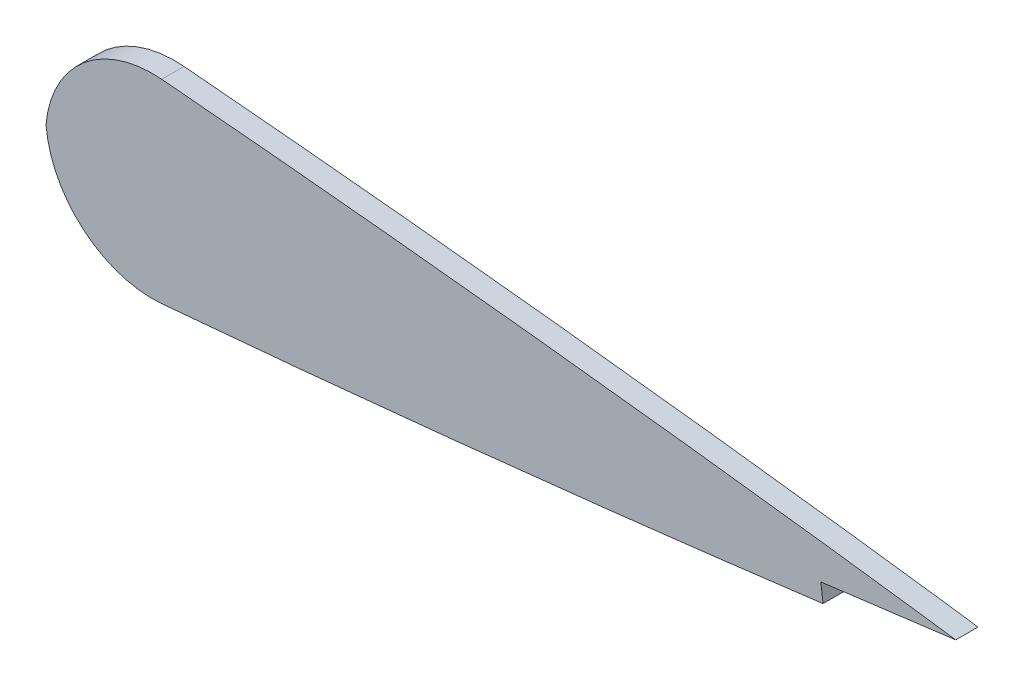
ISO-10303-21;
HEADER;
FILE_DESCRIPTION(('STEP AP214'),'2;1');
FILE_NAME('part.step','',(''),(''),'','','');
FILE_SCHEMA(('AUTOMOTIVE_DESIGN { 1 0 10303 214 1 1 1 1 }'));
ENDSEC;
DATA;
#1=APPLICATION_CONTEXT('core data for automotive mechanical design processes');
#2=APPLICATION_PROTOCOL_DEFINITION('international standard','automotive_design',2000,#1);
#3=PRODUCT_CONTEXT('',#1,'mechanical');
#4=PRODUCT('Part','Part','',(#3));
#5=PRODUCT_RELATED_PRODUCT_CATEGORY('part','',(#4));
#6=PRODUCT_DEFINITION_FORMATION('','',#4);
#7=PRODUCT_DEFINITION_CONTEXT('part definition',#1,'design');
#8=PRODUCT_DEFINITION('design','',#6,#7);
#9=PRODUCT_DEFINITION_SHAPE('','',#8);
#10=(LENGTH_UNIT() NAMED_UNIT(*) SI_UNIT(.MILLI.,.METRE.));
#11=(NAMED_UNIT(*) PLANE_ANGLE_UNIT() SI_UNIT($,.RADIAN.));
#12=(NAMED_UNIT(*) SI_UNIT($,.STERADIAN.) SOLID_ANGLE_UNIT());
#13=UNCERTAINTY_MEASURE_WITH_UNIT(LENGTH_MEASURE(1.E-05),#10,'distance_accuracy_value','');
#14=(GEOMETRIC_REPRESENTATION_CONTEXT(3) GLOBAL_UNCERTAINTY_ASSIGNED_CONTEXT((#13)) GLOBAL_UNIT_ASSIGNED_CONTEXT((#10,
#11,#12)) REPRESENTATION_CONTEXT('',''));
#15=CARTESIAN_POINT('',(0.,0.,0.));
#16=DIRECTION('',(0.,0.,1.));
#17=DIRECTION('',(1.,0.,0.));
#18=AXIS2_PLACEMENT_3D('',#15,#16,#17);
#19=CARTESIAN_POINT('',(318.77,0.4016502,3.175));
#20=CARTESIAN_POINT('',(318.651672050798,0.50081062510207,3.175));
#21=CARTESIAN_POINT('',(317.88713952083,0.407183951533016,3.175));
#22=CARTESIAN_POINT('',(316.525702267064,0.7904298347905,3.175));
#23=CARTESIAN_POINT('',(314.029007456015,1.02731081399014,3.175));
#24=CARTESIAN_POINT('',(310.665580367581,1.53568645613262,3.175));
#25=CARTESIAN_POINT('',(306.332982445315,2.1029997142592,3.175));
#26=CARTESIAN_POINT('',(301.108142880642,2.80218722429085,3.175));
#27=CARTESIAN_POINT('',(295.004655139781,3.59255228155884,3.175));
#28=CARTESIAN_POINT('',(288.066717305627,4.47252129999186,3.175));
#29=CARTESIAN_POINT('',(280.334877507848,5.42667867616247,3.175));
#30=CARTESIAN_POINT('',(271.857503413929,6.44211126091389,3.175));
#31=CARTESIAN_POINT('',(262.68670258513,7.50622472654808,3.175));
#32=CARTESIAN_POINT('',(252.878949160097,8.60453143464443,3.175));
#33=CARTESIAN_POINT('',(242.494745531819,9.72362194936592,3.175));
#34=CARTESIAN_POINT('',(231.598187206488,10.8495970231666,3.175));
#35=CARTESIAN_POINT('',(220.256428580463,11.9679230852741,3.175));
#36=CARTESIAN_POINT('',(208.539426289446,13.0629021970691,3.175));
#37=CARTESIAN_POINT('',(196.519338709918,14.1201595424354,3.175));
#38=CARTESIAN_POINT('',(184.270405083069,15.1220196708537,3.175));
#39=CARTESIAN_POINT('',(171.867889748649,16.0521472129467,3.175));
#40=CARTESIAN_POINT('',(159.388371015463,16.8932736087619,3.175));
#41=CARTESIAN_POINT('',(146.908740176365,17.6278116310836,3.175));
#42=CARTESIAN_POINT('',(134.505824676557,18.23720410278,3.175));
#43=CARTESIAN_POINT('',(122.256224526093,18.705201006698,3.175));
#44=CARTESIAN_POINT('',(110.23510919994,19.0165345268771,3.175));
#45=CARTESIAN_POINT('',(98.5167667377854,19.1559979551147,3.175));
#46=CARTESIAN_POINT('',(87.1732015056204,19.1125234147679,3.175));
#47=CARTESIAN_POINT('',(76.2743495407503,18.8777134468916,3.175));
#48=CARTESIAN_POINT('',(65.8872982521429,18.4456158754961,3.175));
#49=CARTESIAN_POINT('',(56.0759819312477,17.8151004006929,3.175));
#50=CARTESIAN_POINT('',(46.9007012854392,16.9880642018893,3.175));
#51=CARTESIAN_POINT('',(38.4176025007467,15.9709664672286,3.175));
#52=CARTESIAN_POINT('',(30.6783927826995,14.7724611931374,3.175));
#53=CARTESIAN_POINT('',(23.7299698701266,13.4050657428601,3.175));
#54=CARTESIAN_POINT('',(17.6130594258367,11.8842416218078,3.175));
#55=CARTESIAN_POINT('',(12.3624203887116,10.2248187616682,3.175));
#56=CARTESIAN_POINT('',(8.00472945000562,8.44225238170004,3.175));
#57=CARTESIAN_POINT('',(4.55388340735938,6.54860238146803,3.175));
#58=CARTESIAN_POINT('',(2.01519229032135,4.54013127991722,3.175));
#59=CARTESIAN_POINT('',(0.389181284538515,2.36824959719999,3.175));
#60=CARTESIAN_POINT('',(-0.181372315669338,0.,3.175));
#61=CARTESIAN_POINT('',(0.389181284538492,-2.36824959719995,3.175));
#62=CARTESIAN_POINT('',(2.01519229032142,-4.5401312799173,3.175));
#63=CARTESIAN_POINT('',(4.55388340735933,-6.54860238146799,3.175));
#64=CARTESIAN_POINT('',(8.00472945000561,-8.44225238170004,3.175));
#65=CARTESIAN_POINT('',(12.3624203887116,-10.2248187616682,3.175));
#66=CARTESIAN_POINT('',(17.6130594258367,-11.8842416218078,3.175));
#67=CARTESIAN_POINT('',(23.7299698701266,-13.4050657428601,3.175));
#68=CARTESIAN_POINT('',(30.6783927826996,-14.7724611931374,3.175));
#69=CARTESIAN_POINT('',(38.4176025007467,-15.9709664672285,3.175));
#70=CARTESIAN_POINT('',(46.9007012854392,-16.9880642018893,3.175));
#71=CARTESIAN_POINT('',(56.0759819312477,-17.8151004006929,3.175));
#72=CARTESIAN_POINT('',(65.8872982521429,-18.4456158754961,3.175));
#73=CARTESIAN_POINT('',(76.2743495407503,-18.8777134468916,3.175));
#74=CARTESIAN_POINT('',(87.1732015056205,-19.1125234147679,3.175));
#75=CARTESIAN_POINT('',(98.5167667377854,-19.1559979551147,3.175));
#76=CARTESIAN_POINT('',(110.23510919994,-19.0165345268771,3.175));
#77=CARTESIAN_POINT('',(122.256224526093,-18.705201006698,3.175));
#78=CARTESIAN_POINT('',(134.505824676556,-18.23720410278,3.175));
#79=CARTESIAN_POINT('',(146.908740176365,-17.6278116310836,3.175));
#80=CARTESIAN_POINT('',(159.388371015463,-16.8932736087619,3.175));
#81=CARTESIAN_POINT('',(171.867889748649,-16.0521472129467,3.175));
#82=CARTESIAN_POINT('',(184.270405083069,-15.1220196708537,3.175));
#83=CARTESIAN_POINT('',(196.519338709918,-14.1201595424354,3.175));
#84=CARTESIAN_POINT('',(208.539426289446,-13.0629021970691,3.175));
#85=CARTESIAN_POINT('',(220.256428580463,-11.9679230852741,3.175));
#86=CARTESIAN_POINT('',(231.598187206488,-10.8495970231665,3.175));
#87=CARTESIAN_POINT('',(242.494745531819,-9.72362194936593,3.175));
#88=CARTESIAN_POINT('',(252.878949160097,-8.60453143464443,3.175));
#89=CARTESIAN_POINT('',(262.68670258513,-7.50622472654809,3.175));
#90=CARTESIAN_POINT('',(271.857503413929,-6.44211126091389,3.175));
#91=CARTESIAN_POINT('',(280.334877507848,-5.42667867616247,3.175));
#92=CARTESIAN_POINT('',(288.066717305627,-4.47252129999186,3.175));
#93=CARTESIAN_POINT('',(295.004655139781,-3.59255228155884,3.175));
#94=CARTESIAN_POINT('',(301.108142880642,-2.80218722429085,3.175));
#95=CARTESIAN_POINT('',(306.332982445315,-2.10299971425921,3.175));
#96=CARTESIAN_POINT('',(310.66558036758,-1.53568645613261,3.175));
#97=CARTESIAN_POINT('',(314.029007456015,-1.02731081399015,3.175));
#98=CARTESIAN_POINT('',(316.525702267064,-0.790429834790499,3.175));
#99=CARTESIAN_POINT('',(317.88713952083,-0.407183951532999,3.175));
#100=CARTESIAN_POINT('',(318.961628570184,-0.538768719393173,3.175));
#101=CARTESIAN_POINT('',(318.961628570184,0.241062861088163,3.175));
#102=CARTESIAN_POINT('',(318.77,0.4016502,3.175));
#103=B_SPLINE_CURVE_WITH_KNOTS('',3,(#19,#20,#21,#22,#23,#24,#25,#26,#27,#28,#29,#30,#31,#32,
#33,#34,#35,#36,#37,#38,#39,#40,#41,#42,#43,#44,#45,#46,#47,#48,#49,#50,#51,#52,#53,#54,#55,#56,
#57,#58,#59,#60,#61,#62,#63,#64,#65,#66,#67,#68,#69,#70,#71,#72,#73,#74,#75,#76,#77,#78,#79,#80,
#81,#82,#83,#84,#85,#86,#87,#88,#89,#90,#91,#92,#93,#94,#95,#96,#97,#98,#99,#100,#101,#102),
.UNSPECIFIED.,.T.,.F.,(4,1,1,1,1,1,1,1,1,1,1,1,1,1,1,1,1,1,1,1,1,1,1,1,1,1,1,1,1,1,1,1,1,1,1,1,
1,1,1,1,1,1,1,1,1,1,1,1,1,1,1,1,1,1,1,1,1,1,1,1,1,1,1,1,1,1,1,1,1,1,1,1,1,1,1,1,1,1,1,1,1,4),
(0.,0.00076221465102857,0.00304470631082172,0.00683224554312919,0.0121011758037585,
0.0188175356586858,0.026939454793122,0.0364148482585568,0.0471846285955964,0.0591804130998147,
0.0723278736139124,0.0865440610891483,0.101740580336553,0.117823336433574,0.134691452208322,
0.152240154447155,0.170361289964637,0.188941007849542,0.207865435445639,0.227016078022501,
0.246275695980001,0.265524943249896,0.284644966110444,0.303520118268662,0.322034575374331,
0.340078352914118,0.357542593241702,0.374325481920834,0.390329890871888,0.405463889739095,
0.419643801445685,0.43279337139134,0.444843816743186,0.455737920704734,0.465428653233085,
0.473886320085416,0.481101634077569,0.487101684418678,0.491975368345093,0.495930677807379,
0.499382808099288,0.502834938391198,0.506790247853484,0.511663931779899,0.517663982121008,
0.524879296113161,0.533336962965492,0.543027695493843,0.553921799455391,0.565972244807237,
0.579121814752892,0.593301726459482,0.608435725326689,0.624440134277742,0.641223022956875,
0.658687263284459,0.676731040824246,0.695245497929915,0.714120650088133,0.733240672948681,
0.752489920218576,0.771749538176075,0.790900180752937,0.809824608349034,0.82840432623394,
0.846525461751422,0.864074163990254,0.880942279765002,0.897025035862024,0.912221555109428,
0.926437742584664,0.939585203098762,0.95158098760298,0.96235076794002,0.971826161405454,
0.97994808053989,0.986664440394818,0.991933370655447,0.995720909887755,0.998003401547548,
0.998765616198576,1.),.UNSPECIFIED.);
#104=DIRECTION('',(0.,0.,-1.));
#105=VECTOR('',#104,1.);
#106=SURFACE_OF_LINEAR_EXTRUSION('',#103,#105);
#107=DIRECTION('',(0.,0.,1.));
#108=VECTOR('',#107,1.);
#109=CARTESIAN_POINT('',(293.808504280091,-3.74262583123202,0.));
#110=LINE('',#109,#108);
#111=CARTESIAN_POINT('',(293.808504280091,-3.74262583123202,0.));
#112=VERTEX_POINT('',#111);
#113=CARTESIAN_POINT('',(293.808504280091,-3.74262583123202,3.175));
#114=VERTEX_POINT('',#113);
#115=EDGE_CURVE('E103',#112,#114,#110,.T.);
#116=ORIENTED_EDGE('',*,*,#115,.T.);
#117=CARTESIAN_POINT('',(199.575539960691,-13.8459475793617,3.175));
#118=VERTEX_POINT('',#117);
#119=EDGE_CURVE('E131',#118,#114,#103,.T.);
#120=ORIENTED_EDGE('',*,*,#119,.F.);
#121=DIRECTION('',(0.,0.,-1.));
#122=VECTOR('',#121,1.);
#123=CARTESIAN_POINT('',(199.575539960691,-13.8459475793617,3.175));
#124=LINE('',#123,#122);
#125=CARTESIAN_POINT('',(199.575539960691,-13.8459475793617,0.));
#126=VERTEX_POINT('',#125);
#127=EDGE_CURVE('E123',#118,#126,#124,.T.);
#128=ORIENTED_EDGE('',*,*,#127,.T.);
#129=CARTESIAN_POINT('',(318.77,0.4016502,0.));
#130=CARTESIAN_POINT('',(318.651672050798,0.50081062510207,0.));
#131=CARTESIAN_POINT('',(317.88713952083,0.407183951533016,0.));
#132=CARTESIAN_POINT('',(316.525702267064,0.7904298347905,0.));
#133=CARTESIAN_POINT('',(314.029007456015,1.02731081399014,0.));
#134=CARTESIAN_POINT('',(310.665580367581,1.53568645613262,0.));
#135=CARTESIAN_POINT('',(306.332982445315,2.1029997142592,0.));
#136=CARTESIAN_POINT('',(301.108142880642,2.80218722429085,0.));
#137=CARTESIAN_POINT('',(295.004655139781,3.59255228155884,0.));
#138=CARTESIAN_POINT('',(288.066717305627,4.47252129999186,0.));
#139=CARTESIAN_POINT('',(280.334877507848,5.42667867616247,0.));
#140=CARTESIAN_POINT('',(271.857503413929,6.44211126091389,0.));
#141=CARTESIAN_POINT('',(262.68670258513,7.50622472654808,0.));
#142=CARTESIAN_POINT('',(252.878949160097,8.60453143464443,0.));
#143=CARTESIAN_POINT('',(242.494745531819,9.72362194936592,0.));
#144=CARTESIAN_POINT('',(231.598187206488,10.8495970231666,0.));
#145=CARTESIAN_POINT('',(220.256428580463,11.9679230852741,0.));
#146=CARTESIAN_POINT('',(208.539426289446,13.0629021970691,0.));
#147=CARTESIAN_POINT('',(196.519338709918,14.1201595424354,0.));
#148=CARTESIAN_POINT('',(184.270405083069,15.1220196708537,0.));
#149=CARTESIAN_POINT('',(171.867889748649,16.0521472129467,0.));
#150=CARTESIAN_POINT('',(159.388371015463,16.8932736087619,0.));
#151=CARTESIAN_POINT('',(146.908740176365,17.6278116310836,0.));
#152=CARTESIAN_POINT('',(134.505824676557,18.23720410278,0.));
#153=CARTESIAN_POINT('',(122.256224526093,18.705201006698,0.));
#154=CARTESIAN_POINT('',(110.23510919994,19.0165345268771,0.));
#155=CARTESIAN_POINT('',(98.5167667377854,19.1559979551147,0.));
#156=CARTESIAN_POINT('',(87.1732015056204,19.1125234147679,0.));
#157=CARTESIAN_POINT('',(76.2743495407503,18.8777134468916,0.));
#158=CARTESIAN_POINT('',(65.8872982521429,18.4456158754961,0.));
#159=CARTESIAN_POINT('',(56.0759819312477,17.8151004006929,0.));
#160=CARTESIAN_POINT('',(46.9007012854392,16.9880642018893,0.));
#161=CARTESIAN_POINT('',(38.4176025007467,15.9709664672286,0.));
#162=CARTESIAN_POINT('',(30.6783927826995,14.7724611931374,0.));
#163=CARTESIAN_POINT('',(23.7299698701266,13.4050657428601,0.));
#164=CARTESIAN_POINT('',(17.6130594258367,11.8842416218078,0.));
#165=CARTESIAN_POINT('',(12.3624203887116,10.2248187616682,0.));
#166=CARTESIAN_POINT('',(8.00472945000562,8.44225238170004,0.));
#167=CARTESIAN_POINT('',(4.55388340735938,6.54860238146803,0.));
#168=CARTESIAN_POINT('',(2.01519229032135,4.54013127991722,0.));
#169=CARTESIAN_POINT('',(0.389181284538515,2.36824959719999,0.));
#170=CARTESIAN_POINT('',(-0.181372315669338,0.,0.));
#171=CARTESIAN_POINT('',(0.389181284538492,-2.36824959719995,0.));
#172=CARTESIAN_POINT('',(2.01519229032142,-4.5401312799173,0.));
#173=CARTESIAN_POINT('',(4.55388340735933,-6.54860238146799,0.));
#174=CARTESIAN_POINT('',(8.00472945000561,-8.44225238170004,0.));
#175=CARTESIAN_POINT('',(12.3624203887116,-10.2248187616682,0.));
#176=CARTESIAN_POINT('',(17.6130594258367,-11.8842416218078,0.));
#177=CARTESIAN_POINT('',(23.7299698701266,-13.4050657428601,0.));
#178=CARTESIAN_POINT('',(30.6783927826996,-14.7724611931374,0.));
#179=CARTESIAN_POINT('',(38.4176025007467,-15.9709664672285,0.));
#180=CARTESIAN_POINT('',(46.9007012854392,-16.9880642018893,0.));
#181=CARTESIAN_POINT('',(56.0759819312477,-17.8151004006929,0.));
#182=CARTESIAN_POINT('',(65.8872982521429,-18.4456158754961,0.));
#183=CARTESIAN_POINT('',(76.2743495407503,-18.8777134468916,0.));
#184=CARTESIAN_POINT('',(87.1732015056205,-19.1125234147679,0.));
#185=CARTESIAN_POINT('',(98.5167667377854,-19.1559979551147,0.));
#186=CARTESIAN_POINT('',(110.23510919994,-19.0165345268771,0.));
#187=CARTESIAN_POINT('',(122.256224526093,-18.705201006698,0.));
#188=CARTESIAN_POINT('',(134.505824676556,-18.23720410278,0.));
#189=CARTESIAN_POINT('',(146.908740176365,-17.6278116310836,0.));
#190=CARTESIAN_POINT('',(159.388371015463,-16.8932736087619,0.));
#191=CARTESIAN_POINT('',(171.867889748649,-16.0521472129467,0.));
#192=CARTESIAN_POINT('',(184.270405083069,-15.1220196708537,0.));
#193=CARTESIAN_POINT('',(196.519338709918,-14.1201595424354,0.));
#194=CARTESIAN_POINT('',(208.539426289446,-13.0629021970691,0.));
#195=CARTESIAN_POINT('',(220.256428580463,-11.9679230852741,0.));
#196=CARTESIAN_POINT('',(231.598187206488,-10.8495970231665,0.));
#197=CARTESIAN_POINT('',(242.494745531819,-9.72362194936593,0.));
#198=CARTESIAN_POINT('',(252.878949160097,-8.60453143464443,0.));
#199=CARTESIAN_POINT('',(262.68670258513,-7.50622472654809,0.));
#200=CARTESIAN_POINT('',(271.857503413929,-6.44211126091389,0.));
#201=CARTESIAN_POINT('',(280.334877507848,-5.42667867616247,0.));
#202=CARTESIAN_POINT('',(288.066717305627,-4.47252129999186,0.));
#203=CARTESIAN_POINT('',(295.004655139781,-3.59255228155884,0.));
#204=CARTESIAN_POINT('',(301.108142880642,-2.80218722429085,0.));
#205=CARTESIAN_POINT('',(306.332982445315,-2.10299971425921,0.));
#206=CARTESIAN_POINT('',(310.66558036758,-1.53568645613261,0.));
#207=CARTESIAN_POINT('',(314.029007456015,-1.02731081399015,0.));
#208=CARTESIAN_POINT('',(316.525702267064,-0.790429834790499,0.));
#209=CARTESIAN_POINT('',(317.88713952083,-0.407183951532999,0.));
#210=CARTESIAN_POINT('',(318.961628570184,-0.538768719393173,0.));
#211=CARTESIAN_POINT('',(318.961628570184,0.241062861088163,0.));
#212=CARTESIAN_POINT('',(318.77,0.4016502,0.));
#213=B_SPLINE_CURVE_WITH_KNOTS('',3,(#129,#130,#131,#132,#133,#134,#135,#136,#137,#138,#139,
#140,#141,#142,#143,#144,#145,#146,#147,#148,#149,#150,#151,#152,#153,#154,#155,#156,#157,#158,
#159,#160,#161,#162,#163,#164,#165,#166,#167,#168,#169,#170,#171,#172,#173,#174,#175,#176,#177,
#178,#179,#180,#181,#182,#183,#184,#185,#186,#187,#188,#189,#190,#191,#192,#193,#194,#195,#196,
#197,#198,#199,#200,#201,#202,#203,#204,#205,#206,#207,#208,#209,#210,#211,#212),.UNSPECIFIED.,
.T.,.F.,(4,1,1,1,1,1,1,1,1,1,1,1,1,1,1,1,1,1,1,1,1,1,1,1,1,1,1,1,1,1,1,1,1,1,1,1,1,1,1,1,1,1,1,
1,1,1,1,1,1,1,1,1,1,1,1,1,1,1,1,1,1,1,1,1,1,1,1,1,1,1,1,1,1,1,1,1,1,1,1,1,1,4),(0.,
0.00076221465102857,0.00304470631082172,0.00683224554312919,0.0121011758037585,
0.0188175356586858,0.026939454793122,0.0364148482585568,0.0471846285955964,0.0591804130998147,
0.0723278736139124,0.0865440610891483,0.101740580336553,0.117823336433574,0.134691452208322,
0.152240154447155,0.170361289964637,0.188941007849542,0.207865435445639,0.227016078022501,
0.246275695980001,0.265524943249896,0.284644966110444,0.303520118268662,0.322034575374331,
0.340078352914118,0.357542593241702,0.374325481920834,0.390329890871888,0.405463889739095,
0.419643801445685,0.43279337139134,0.444843816743186,0.455737920704734,0.465428653233085,
0.473886320085416,0.481101634077569,0.487101684418678,0.491975368345093,0.495930677807379,
0.499382808099288,0.502834938391198,0.506790247853484,0.511663931779899,0.517663982121008,
0.524879296113161,0.533336962965492,0.543027695493843,0.553921799455391,0.565972244807237,
0.579121814752892,0.593301726459482,0.608435725326689,0.624440134277742,0.641223022956875,
0.658687263284459,0.676731040824246,0.695245497929915,0.714120650088133,0.733240672948681,
0.752489920218576,0.771749538176075,0.790900180752937,0.809824608349034,0.82840432623394,
0.846525461751422,0.864074163990254,0.880942279765002,0.897025035862024,0.912221555109428,
0.926437742584664,0.939585203098762,0.95158098760298,0.96235076794002,0.971826161405454,
0.97994808053989,0.986664440394818,0.991933370655447,0.995720909887755,0.998003401547548,
0.998765616198576,1.),.UNSPECIFIED.);
#214=EDGE_CURVE('E116',#126,#112,#213,.T.);
#215=ORIENTED_EDGE('',*,*,#214,.T.);
#216=EDGE_LOOP('',(#116,#120,#128,#215));
#217=FACE_BOUND('',#216,.T.);
#218=ADVANCED_FACE('F51',(#217),#106,.F.);
#219=CARTESIAN_POINT('',(312.710468317177,1.23062088336001,3.175));
#220=VERTEX_POINT('',#219);
#221=CARTESIAN_POINT('',(199.575539960691,13.8459475793617,3.175));
#222=VERTEX_POINT('',#221);
#223=EDGE_CURVE('E125',#220,#222,#103,.T.);
#224=ORIENTED_EDGE('',*,*,#223,.F.);
#225=DIRECTION('',(0.,0.,-1.));
#226=VECTOR('',#225,1.);
#227=CARTESIAN_POINT('',(312.710468350961,1.23062088767225,3.175));
#228=LINE('',#227,#226);
#229=CARTESIAN_POINT('',(312.710468317177,1.23062088336001,0.));
#230=VERTEX_POINT('',#229);
#231=EDGE_CURVE('E162',#220,#230,#228,.T.);
#232=ORIENTED_EDGE('',*,*,#231,.T.);
#233=CARTESIAN_POINT('',(199.575539960691,13.8459475793617,0.));
#234=VERTEX_POINT('',#233);
#235=EDGE_CURVE('E126',#230,#234,#213,.T.);
#236=ORIENTED_EDGE('',*,*,#235,.T.);
#237=DIRECTION('',(0.,0.,-1.));
#238=VECTOR('',#237,1.);
#239=CARTESIAN_POINT('',(199.575539960691,13.8459475793617,0.));
#240=LINE('',#239,#238);
#241=EDGE_CURVE('E150',#234,#222,#240,.F.);
#242=ORIENTED_EDGE('',*,*,#241,.T.);
#243=EDGE_LOOP('',(#224,#232,#236,#242));
#244=FACE_BOUND('',#243,.T.);
#245=ADVANCED_FACE('F208',(#244),#106,.F.);
#246=CARTESIAN_POINT('',(0.0170900845920282,-0.403411610866982,3.175));
#247=DIRECTION('',(0.,0.,-1.));
#248=DIRECTION('',(-1.,0.,0.));
#249=AXIS2_PLACEMENT_3D('',#246,#247,#248);
#250=PLANE('',#249);
#251=ORIENTED_EDGE('',*,*,#119,.T.);
#252=DIRECTION('',(0.126612416473665,-0.991952264977856,0.));
#253=VECTOR('',#252,1.);
#254=CARTESIAN_POINT('',(293.808504280091,-3.74262583123202,3.175));
#255=LINE('',#254,#253);
#256=CARTESIAN_POINT('',(293.486908742248,-1.22306707818825,3.175));
#257=VERTEX_POINT('',#256);
#258=EDGE_CURVE('E106',#257,#114,#255,.T.);
#259=ORIENTED_EDGE('',*,*,#258,.F.);
#260=DIRECTION('',(-0.991952264977859,-0.126612416473643,0.));
#261=VECTOR('',#260,1.);
#262=CARTESIAN_POINT('',(293.486908742248,-1.22306707818825,3.175));
#263=LINE('',#262,#261);
#264=EDGE_CURVE('E119',#220,#257,#263,.T.);
#265=ORIENTED_EDGE('',*,*,#264,.F.);
#266=ORIENTED_EDGE('',*,*,#223,.T.);
#267=CARTESIAN_POINT('',(198.263721427638,-1.33748853162255,3.175));
#268=DIRECTION('',(0.,0.,-1.));
#269=DIRECTION('',(-1.,0.,0.));
#270=AXIS2_PLACEMENT_3D('',#267,#268,#269);
#271=CIRCLE('',#270,15.24);
#272=CARTESIAN_POINT('',(183.082525018008,1.51571463713474E-13,3.175));
#273=VERTEX_POINT('',#272);
#274=EDGE_CURVE('E141',#222,#273,#271,.F.);
#275=ORIENTED_EDGE('',*,*,#274,.T.);
#276=CARTESIAN_POINT('',(198.263721427638,1.33748853162254,3.175));
#277=DIRECTION('',(0.,0.,-1.));
#278=DIRECTION('',(-1.,0.,0.));
#279=AXIS2_PLACEMENT_3D('',#276,#277,#278);
#280=CIRCLE('',#279,15.24);
#281=EDGE_CURVE('E147',#273,#118,#280,.F.);
#282=ORIENTED_EDGE('',*,*,#281,.T.);
#283=EDGE_LOOP('',(#251,#259,#265,#266,#275,#282));
#284=FACE_BOUND('',#283,.T.);
#285=ADVANCED_FACE('F187',(#284),#250,.F.);
#286=CARTESIAN_POINT('',(0.0170900845920282,-0.403411610866982,0.));
#287=DIRECTION('',(0.,0.,-1.));
#288=DIRECTION('',(-1.,0.,0.));
#289=AXIS2_PLACEMENT_3D('',#286,#287,#288);
#290=PLANE('',#289);
#291=DIRECTION('',(0.126612416473665,-0.991952264977856,0.));
#292=VECTOR('',#291,1.);
#293=CARTESIAN_POINT('',(293.808504280091,-3.74262583123202,0.));
#294=LINE('',#293,#292);
#295=CARTESIAN_POINT('',(293.486908742248,-1.22306707818825,0.));
#296=VERTEX_POINT('',#295);
#297=EDGE_CURVE('E67',#296,#112,#294,.T.);
#298=ORIENTED_EDGE('',*,*,#297,.T.);
#299=ORIENTED_EDGE('',*,*,#214,.F.);
#300=CARTESIAN_POINT('',(198.263721427638,1.33748853162254,0.));
#301=DIRECTION('',(0.,0.,-1.));
#302=DIRECTION('',(-1.,0.,0.));
#303=AXIS2_PLACEMENT_3D('',#300,#301,#302);
#304=CIRCLE('',#303,15.24);
#305=CARTESIAN_POINT('',(183.082525018008,1.51571463713474E-13,0.));
#306=VERTEX_POINT('',#305);
#307=EDGE_CURVE('E60',#126,#306,#304,.T.);
#308=ORIENTED_EDGE('',*,*,#307,.T.);
#309=CARTESIAN_POINT('',(198.263721427638,-1.33748853162255,0.));
#310=DIRECTION('',(0.,0.,-1.));
#311=DIRECTION('',(-1.,0.,0.));
#312=AXIS2_PLACEMENT_3D('',#309,#310,#311);
#313=CIRCLE('',#312,15.24);
#314=EDGE_CURVE('E156',#306,#234,#313,.T.);
#315=ORIENTED_EDGE('',*,*,#314,.T.);
#316=ORIENTED_EDGE('',*,*,#235,.F.);
#317=DIRECTION('',(0.991952264977859,0.126612416473643,0.));
#318=VECTOR('',#317,1.);
#319=CARTESIAN_POINT('',(4.82456125902701,-38.067821256577,0.));
#320=LINE('',#319,#318);
#321=EDGE_CURVE('E11',#296,#230,#320,.T.);
#322=ORIENTED_EDGE('',*,*,#321,.F.);
#323=EDGE_LOOP('',(#298,#299,#308,#315,#316,#322));
#324=FACE_BOUND('',#323,.T.);
#325=ADVANCED_FACE('F115',(#324),#290,.T.);
#326=CARTESIAN_POINT('',(198.263721427638,-1.33748853162255,1.5875));
#327=DIRECTION('',(0.,0.,-1.));
#328=DIRECTION('',(-1.,0.,0.));
#329=AXIS2_PLACEMENT_3D('',#326,#327,#328);
#330=CYLINDRICAL_SURFACE('',#329,15.24);
#331=ORIENTED_EDGE('',*,*,#241,.F.);
#332=ORIENTED_EDGE('',*,*,#314,.F.);
#333=DIRECTION('',(0.,0.,-1.));
#334=VECTOR('',#333,1.);
#335=CARTESIAN_POINT('',(183.082525018008,1.50704101975485E-13,1.5875));
#336=LINE('',#335,#334);
#337=EDGE_CURVE('E133',#273,#306,#336,.T.);
#338=ORIENTED_EDGE('',*,*,#337,.F.);
#339=ORIENTED_EDGE('',*,*,#274,.F.);
#340=EDGE_LOOP('',(#331,#332,#338,#339));
#341=FACE_BOUND('',#340,.T.);
#342=ADVANCED_FACE('F53',(#341),#330,.T.);
#343=CARTESIAN_POINT('',(198.263721427638,1.33748853162254,1.5875));
#344=DIRECTION('',(0.,0.,-1.));
#345=DIRECTION('',(-1.,0.,0.));
#346=AXIS2_PLACEMENT_3D('',#343,#344,#345);
#347=CYLINDRICAL_SURFACE('',#346,15.24);
#348=ORIENTED_EDGE('',*,*,#307,.F.);
#349=ORIENTED_EDGE('',*,*,#127,.F.);
#350=ORIENTED_EDGE('',*,*,#281,.F.);
#351=ORIENTED_EDGE('',*,*,#337,.T.);
#352=EDGE_LOOP('',(#348,#349,#350,#351));
#353=FACE_BOUND('',#352,.T.);
#354=ADVANCED_FACE('F198',(#353),#347,.T.);
#355=CARTESIAN_POINT('',(293.486908742248,-1.22306707818825,0.));
#356=DIRECTION('',(-0.126612416473643,0.991952264977859,0.));
#357=DIRECTION('',(-0.991952264977859,-0.126612416473643,0.));
#358=AXIS2_PLACEMENT_3D('',#355,#356,#357);
#359=PLANE('',#358);
#360=ORIENTED_EDGE('',*,*,#264,.T.);
#361=DIRECTION('',(0.,0.,1.));
#362=VECTOR('',#361,1.);
#363=CARTESIAN_POINT('',(293.486908742248,-1.22306707818825,0.));
#364=LINE('',#363,#362);
#365=EDGE_CURVE('E112',#296,#257,#364,.T.);
#366=ORIENTED_EDGE('',*,*,#365,.F.);
#367=ORIENTED_EDGE('',*,*,#321,.T.);
#368=ORIENTED_EDGE('',*,*,#231,.F.);
#369=EDGE_LOOP('',(#360,#366,#367,#368));
#370=FACE_BOUND('',#369,.T.);
#371=ADVANCED_FACE('F185',(#370),#359,.F.);
#372=CARTESIAN_POINT('',(293.808504280091,-3.74262583123202,0.));
#373=DIRECTION('',(-0.991952264977856,-0.126612416473665,0.));
#374=DIRECTION('',(0.126612416473665,-0.991952264977856,0.));
#375=AXIS2_PLACEMENT_3D('',#372,#373,#374);
#376=PLANE('',#375);
#377=ORIENTED_EDGE('',*,*,#258,.T.);
#378=ORIENTED_EDGE('',*,*,#115,.F.);
#379=ORIENTED_EDGE('',*,*,#297,.F.);
#380=ORIENTED_EDGE('',*,*,#365,.T.);
#381=EDGE_LOOP('',(#377,#378,#379,#380));
#382=FACE_BOUND('',#381,.T.);
#383=ADVANCED_FACE('F104',(#382),#376,.F.);
#384=CLOSED_SHELL('',(#218,#245,#285,#325,#342,#354,#371,#383));
#385=MANIFOLD_SOLID_BREP('B2',#384);
#386=ADVANCED_BREP_SHAPE_REPRESENTATION('',(#18,#385),#14);
#387=SHAPE_DEFINITION_REPRESENTATION(#9,#386);
ENDSEC;
END-ISO-10303-21;
